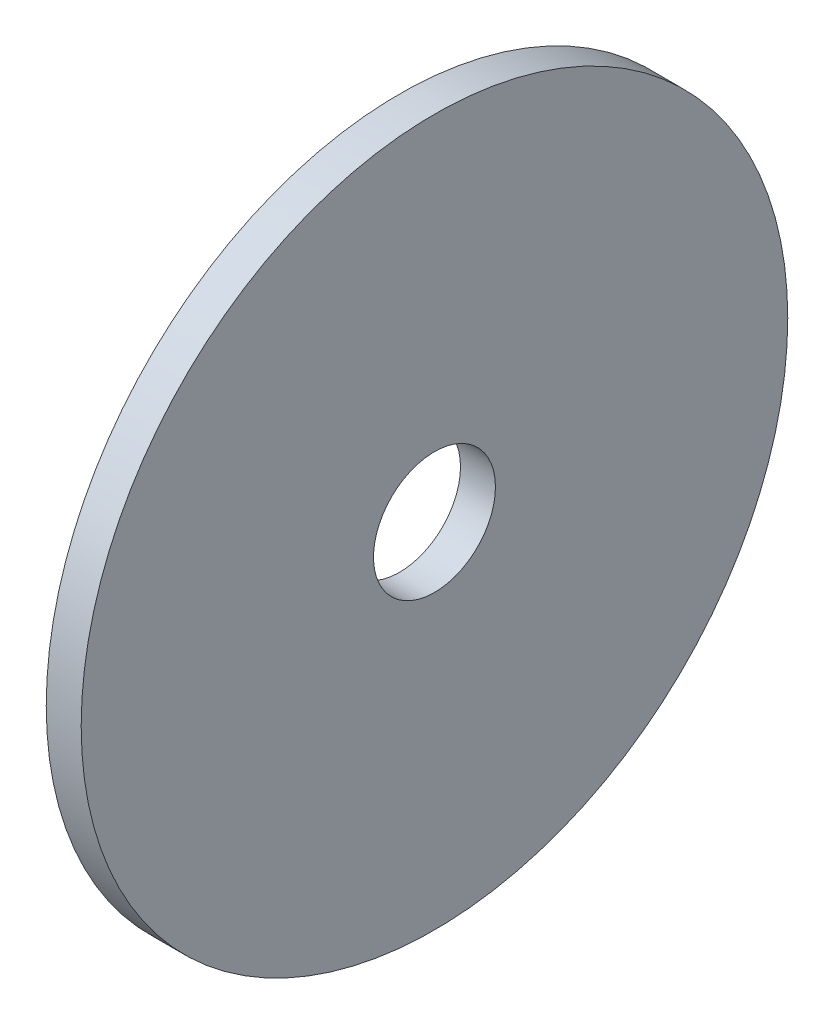
ISO-10303-21;
HEADER;
FILE_DESCRIPTION(('STEP AP214'),'2;1');
FILE_NAME('part.step','',(''),(''),'','','');
FILE_SCHEMA(('AUTOMOTIVE_DESIGN { 1 0 10303 214 1 1 1 1 }'));
ENDSEC;
DATA;
#1=APPLICATION_CONTEXT('core data for automotive mechanical design processes');
#2=APPLICATION_PROTOCOL_DEFINITION('international standard','automotive_design',2000,#1);
#3=PRODUCT_CONTEXT('',#1,'mechanical');
#4=PRODUCT('Part','Part','',(#3));
#5=PRODUCT_RELATED_PRODUCT_CATEGORY('part','',(#4));
#6=PRODUCT_DEFINITION_FORMATION('','',#4);
#7=PRODUCT_DEFINITION_CONTEXT('part definition',#1,'design');
#8=PRODUCT_DEFINITION('design','',#6,#7);
#9=PRODUCT_DEFINITION_SHAPE('','',#8);
#10=(LENGTH_UNIT() NAMED_UNIT(*) SI_UNIT(.MILLI.,.METRE.));
#11=(NAMED_UNIT(*) PLANE_ANGLE_UNIT() SI_UNIT($,.RADIAN.));
#12=(NAMED_UNIT(*) SI_UNIT($,.STERADIAN.) SOLID_ANGLE_UNIT());
#13=UNCERTAINTY_MEASURE_WITH_UNIT(LENGTH_MEASURE(1.E-05),#10,'distance_accuracy_value','');
#14=(GEOMETRIC_REPRESENTATION_CONTEXT(3) GLOBAL_UNCERTAINTY_ASSIGNED_CONTEXT((#13)) GLOBAL_UNIT_ASSIGNED_CONTEXT((#10,
#11,#12)) REPRESENTATION_CONTEXT('',''));
#15=CARTESIAN_POINT('',(0.,0.,0.));
#16=DIRECTION('',(0.,0.,1.));
#17=DIRECTION('',(1.,0.,0.));
#18=AXIS2_PLACEMENT_3D('',#15,#16,#17);
#19=CARTESIAN_POINT('',(531.495,0.,0.));
#20=DIRECTION('',(1.,0.,0.));
#21=DIRECTION('',(0.,0.,-1.));
#22=AXIS2_PLACEMENT_3D('',#19,#20,#21);
#23=PLANE('',#22);
#24=CARTESIAN_POINT('',(531.495,0.,0.));
#25=DIRECTION('',(1.,0.,0.));
#26=DIRECTION('',(0.,0.,-1.));
#27=AXIS2_PLACEMENT_3D('',#24,#25,#26);
#28=CIRCLE('',#27,9.525);
#29=CARTESIAN_POINT('',(531.495,0.,-9.525));
#30=VERTEX_POINT('',#29);
#31=EDGE_CURVE('E49',#30,#30,#28,.T.);
#32=ORIENTED_EDGE('',*,*,#31,.F.);
#33=EDGE_LOOP('',(#32));
#34=FACE_BOUND('',#33,.T.);
#35=CARTESIAN_POINT('',(531.495,0.,0.));
#36=DIRECTION('',(1.,0.,0.));
#37=DIRECTION('',(0.,0.,-1.));
#38=AXIS2_PLACEMENT_3D('',#35,#36,#37);
#39=CIRCLE('',#38,55.1963122114712);
#40=CARTESIAN_POINT('',(531.495,0.,-55.1963122114712));
#41=VERTEX_POINT('',#40);
#42=EDGE_CURVE('E60',#41,#41,#39,.T.);
#43=ORIENTED_EDGE('',*,*,#42,.T.);
#44=EDGE_LOOP('',(#43));
#45=FACE_BOUND('',#44,.T.);
#46=ADVANCED_FACE('F46',(#34,#45),#23,.T.);
#47=CARTESIAN_POINT('',(526.034,0.,0.));
#48=DIRECTION('',(1.,0.,0.));
#49=DIRECTION('',(0.,0.,-1.));
#50=AXIS2_PLACEMENT_3D('',#47,#48,#49);
#51=CYLINDRICAL_SURFACE('',#50,55.1963122114712);
#52=CARTESIAN_POINT('',(526.034,0.,0.));
#53=DIRECTION('',(1.,0.,0.));
#54=DIRECTION('',(0.,0.,-1.));
#55=AXIS2_PLACEMENT_3D('',#52,#53,#54);
#56=CIRCLE('',#55,55.1963122114712);
#57=CARTESIAN_POINT('',(526.034,0.,-55.1963122114712));
#58=VERTEX_POINT('',#57);
#59=EDGE_CURVE('E58',#58,#58,#56,.T.);
#60=ORIENTED_EDGE('',*,*,#59,.T.);
#61=EDGE_LOOP('',(#60));
#62=FACE_BOUND('',#61,.T.);
#63=ORIENTED_EDGE('',*,*,#42,.F.);
#64=EDGE_LOOP('',(#63));
#65=FACE_BOUND('',#64,.T.);
#66=ADVANCED_FACE('F68',(#62,#65),#51,.T.);
#67=CARTESIAN_POINT('',(526.034,0.,0.));
#68=DIRECTION('',(1.,0.,0.));
#69=DIRECTION('',(0.,0.,-1.));
#70=AXIS2_PLACEMENT_3D('',#67,#68,#69);
#71=CYLINDRICAL_SURFACE('',#70,9.525);
#72=CARTESIAN_POINT('',(526.034,0.,0.));
#73=DIRECTION('',(1.,0.,0.));
#74=DIRECTION('',(0.,0.,-1.));
#75=AXIS2_PLACEMENT_3D('',#72,#73,#74);
#76=CIRCLE('',#75,9.525);
#77=CARTESIAN_POINT('',(526.034,0.,-9.525));
#78=VERTEX_POINT('',#77);
#79=EDGE_CURVE('E11',#78,#78,#76,.T.);
#80=ORIENTED_EDGE('',*,*,#79,.F.);
#81=EDGE_LOOP('',(#80));
#82=FACE_BOUND('',#81,.T.);
#83=ORIENTED_EDGE('',*,*,#31,.T.);
#84=EDGE_LOOP('',(#83));
#85=FACE_BOUND('',#84,.T.);
#86=ADVANCED_FACE('F73',(#82,#85),#71,.F.);
#87=CARTESIAN_POINT('',(526.034,0.,0.));
#88=DIRECTION('',(1.,0.,0.));
#89=DIRECTION('',(0.,0.,-1.));
#90=AXIS2_PLACEMENT_3D('',#87,#88,#89);
#91=PLANE('',#90);
#92=ORIENTED_EDGE('',*,*,#79,.T.);
#93=EDGE_LOOP('',(#92));
#94=FACE_BOUND('',#93,.T.);
#95=ORIENTED_EDGE('',*,*,#59,.F.);
#96=EDGE_LOOP('',(#95));
#97=FACE_BOUND('',#96,.T.);
#98=ADVANCED_FACE('F71',(#94,#97),#91,.F.);
#99=CLOSED_SHELL('',(#46,#66,#86,#98));
#100=MANIFOLD_SOLID_BREP('B2',#99);
#101=ADVANCED_BREP_SHAPE_REPRESENTATION('',(#18,#100),#14);
#102=SHAPE_DEFINITION_REPRESENTATION(#9,#101);
ENDSEC;
END-ISO-10303-21;
